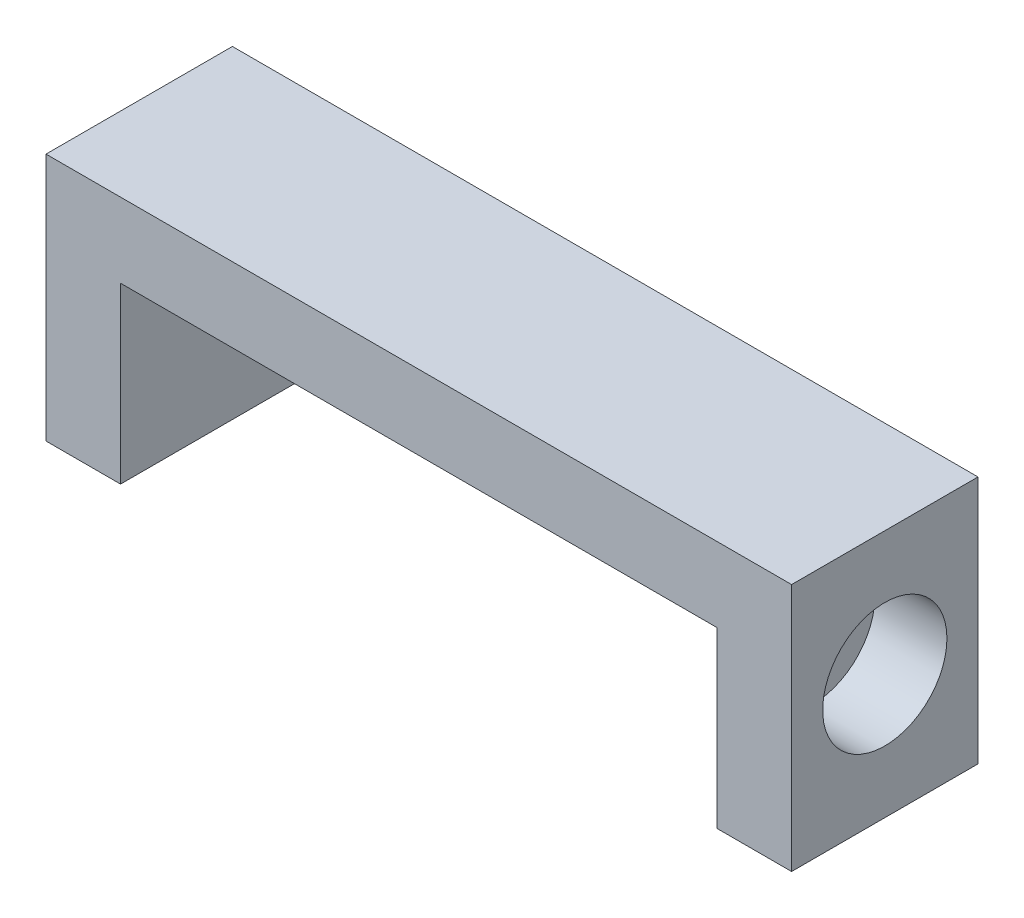
ISO-10303-21;
HEADER;
FILE_DESCRIPTION(('STEP AP214'),'2;1');
FILE_NAME('part.step','',(''),(''),'','','');
FILE_SCHEMA(('AUTOMOTIVE_DESIGN { 1 0 10303 214 1 1 1 1 }'));
ENDSEC;
DATA;
#1=APPLICATION_CONTEXT('core data for automotive mechanical design processes');
#2=APPLICATION_PROTOCOL_DEFINITION('international standard','automotive_design',2000,#1);
#3=PRODUCT_CONTEXT('',#1,'mechanical');
#4=PRODUCT('Part','Part','',(#3));
#5=PRODUCT_RELATED_PRODUCT_CATEGORY('part','',(#4));
#6=PRODUCT_DEFINITION_FORMATION('','',#4);
#7=PRODUCT_DEFINITION_CONTEXT('part definition',#1,'design');
#8=PRODUCT_DEFINITION('design','',#6,#7);
#9=PRODUCT_DEFINITION_SHAPE('','',#8);
#10=(LENGTH_UNIT() NAMED_UNIT(*) SI_UNIT(.MILLI.,.METRE.));
#11=(NAMED_UNIT(*) PLANE_ANGLE_UNIT() SI_UNIT($,.RADIAN.));
#12=(NAMED_UNIT(*) SI_UNIT($,.STERADIAN.) SOLID_ANGLE_UNIT());
#13=UNCERTAINTY_MEASURE_WITH_UNIT(LENGTH_MEASURE(1.E-05),#10,'distance_accuracy_value','');
#14=(GEOMETRIC_REPRESENTATION_CONTEXT(3) GLOBAL_UNCERTAINTY_ASSIGNED_CONTEXT((#13)) GLOBAL_UNIT_ASSIGNED_CONTEXT((#10,
#11,#12)) REPRESENTATION_CONTEXT('',''));
#15=CARTESIAN_POINT('',(0.,0.,0.));
#16=DIRECTION('',(0.,0.,1.));
#17=DIRECTION('',(1.,0.,0.));
#18=AXIS2_PLACEMENT_3D('',#15,#16,#17);
#19=CARTESIAN_POINT('',(-15.,0.,0.));
#20=DIRECTION('',(1.,0.,0.));
#21=DIRECTION('',(0.,0.,-1.));
#22=AXIS2_PLACEMENT_3D('',#19,#20,#21);
#23=CYLINDRICAL_SURFACE('',#22,2.5);
#24=CARTESIAN_POINT('',(-12.1,0.,0.));
#25=DIRECTION('',(-1.,0.,0.));
#26=DIRECTION('',(0.,0.,1.));
#27=AXIS2_PLACEMENT_3D('',#24,#25,#26);
#28=CIRCLE('',#27,2.5);
#29=CARTESIAN_POINT('',(-12.1,0.,2.5));
#30=VERTEX_POINT('',#29);
#31=EDGE_CURVE('E213',#30,#30,#28,.T.);
#32=ORIENTED_EDGE('',*,*,#31,.F.);
#33=EDGE_LOOP('',(#32));
#34=FACE_BOUND('',#33,.T.);
#35=CARTESIAN_POINT('',(-15.,0.,0.));
#36=DIRECTION('',(1.,0.,0.));
#37=DIRECTION('',(0.,0.,-1.));
#38=AXIS2_PLACEMENT_3D('',#35,#36,#37);
#39=CIRCLE('',#38,2.5);
#40=CARTESIAN_POINT('',(-15.,0.,-2.5));
#41=VERTEX_POINT('',#40);
#42=EDGE_CURVE('E173',#41,#41,#39,.T.);
#43=ORIENTED_EDGE('',*,*,#42,.F.);
#44=EDGE_LOOP('',(#43));
#45=FACE_BOUND('',#44,.T.);
#46=ADVANCED_FACE('F33',(#34,#45),#23,.F.);
#47=CARTESIAN_POINT('',(-15.,-5.,3.75));
#48=DIRECTION('',(0.,1.,0.));
#49=DIRECTION('',(0.,0.,1.));
#50=AXIS2_PLACEMENT_3D('',#47,#48,#49);
#51=PLANE('',#50);
#52=DIRECTION('',(1.,0.,0.));
#53=VECTOR('',#52,1.);
#54=CARTESIAN_POINT('',(-15.,-5.,-3.75));
#55=LINE('',#54,#53);
#56=CARTESIAN_POINT('',(-15.,-5.,-3.75));
#57=VERTEX_POINT('',#56);
#58=CARTESIAN_POINT('',(-12.,-5.,-3.75));
#59=VERTEX_POINT('',#58);
#60=EDGE_CURVE('E122',#57,#59,#55,.T.);
#61=ORIENTED_EDGE('',*,*,#60,.T.);
#62=DIRECTION('',(0.,0.,1.));
#63=VECTOR('',#62,1.);
#64=CARTESIAN_POINT('',(-12.,-5.,-3.751));
#65=LINE('',#64,#63);
#66=CARTESIAN_POINT('',(-12.,-5.,3.75));
#67=VERTEX_POINT('',#66);
#68=EDGE_CURVE('E104',#59,#67,#65,.T.);
#69=ORIENTED_EDGE('',*,*,#68,.T.);
#70=DIRECTION('',(1.,0.,0.));
#71=VECTOR('',#70,1.);
#72=CARTESIAN_POINT('',(-15.,-5.,3.75));
#73=LINE('',#72,#71);
#74=CARTESIAN_POINT('',(-15.,-5.,3.75));
#75=VERTEX_POINT('',#74);
#76=EDGE_CURVE('E142',#75,#67,#73,.T.);
#77=ORIENTED_EDGE('',*,*,#76,.F.);
#78=DIRECTION('',(0.,0.,-1.));
#79=VECTOR('',#78,1.);
#80=CARTESIAN_POINT('',(-15.,-5.,3.75));
#81=LINE('',#80,#79);
#82=EDGE_CURVE('E42',#75,#57,#81,.T.);
#83=ORIENTED_EDGE('',*,*,#82,.T.);
#84=EDGE_LOOP('',(#61,#69,#77,#83));
#85=FACE_BOUND('',#84,.T.);
#86=ADVANCED_FACE('F124',(#85),#51,.F.);
#87=CARTESIAN_POINT('',(-15.,5.,3.75));
#88=DIRECTION('',(0.,1.,0.));
#89=DIRECTION('',(0.,0.,1.));
#90=AXIS2_PLACEMENT_3D('',#87,#88,#89);
#91=PLANE('',#90);
#92=DIRECTION('',(0.,0.,-1.));
#93=VECTOR('',#92,1.);
#94=CARTESIAN_POINT('',(15.,5.,3.75));
#95=LINE('',#94,#93);
#96=CARTESIAN_POINT('',(15.,5.,3.75));
#97=VERTEX_POINT('',#96);
#98=CARTESIAN_POINT('',(15.,5.,-3.75));
#99=VERTEX_POINT('',#98);
#100=EDGE_CURVE('E37',#97,#99,#95,.T.);
#101=ORIENTED_EDGE('',*,*,#100,.T.);
#102=DIRECTION('',(1.,0.,0.));
#103=VECTOR('',#102,1.);
#104=CARTESIAN_POINT('',(-15.,5.,-3.75));
#105=LINE('',#104,#103);
#106=CARTESIAN_POINT('',(-15.,5.,-3.75));
#107=VERTEX_POINT('',#106);
#108=EDGE_CURVE('E148',#107,#99,#105,.T.);
#109=ORIENTED_EDGE('',*,*,#108,.F.);
#110=DIRECTION('',(0.,0.,-1.));
#111=VECTOR('',#110,1.);
#112=CARTESIAN_POINT('',(-15.,5.,3.75));
#113=LINE('',#112,#111);
#114=CARTESIAN_POINT('',(-15.,5.,3.75));
#115=VERTEX_POINT('',#114);
#116=EDGE_CURVE('E11',#115,#107,#113,.T.);
#117=ORIENTED_EDGE('',*,*,#116,.F.);
#118=DIRECTION('',(1.,0.,0.));
#119=VECTOR('',#118,1.);
#120=CARTESIAN_POINT('',(-15.,5.,3.75));
#121=LINE('',#120,#119);
#122=EDGE_CURVE('E80',#115,#97,#121,.T.);
#123=ORIENTED_EDGE('',*,*,#122,.T.);
#124=EDGE_LOOP('',(#101,#109,#117,#123));
#125=FACE_BOUND('',#124,.T.);
#126=ADVANCED_FACE('F35',(#125),#91,.T.);
#127=CARTESIAN_POINT('',(-15.,-5.,3.75));
#128=DIRECTION('',(-1.,0.,0.));
#129=DIRECTION('',(0.,0.,1.));
#130=AXIS2_PLACEMENT_3D('',#127,#128,#129);
#131=PLANE('',#130);
#132=ORIENTED_EDGE('',*,*,#42,.T.);
#133=EDGE_LOOP('',(#132));
#134=FACE_BOUND('',#133,.T.);
#135=DIRECTION('',(0.,1.,0.));
#136=VECTOR('',#135,1.);
#137=CARTESIAN_POINT('',(-15.,-5.,-3.75));
#138=LINE('',#137,#136);
#139=EDGE_CURVE('E125',#57,#107,#138,.T.);
#140=ORIENTED_EDGE('',*,*,#139,.F.);
#141=ORIENTED_EDGE('',*,*,#82,.F.);
#142=DIRECTION('',(0.,1.,0.));
#143=VECTOR('',#142,1.);
#144=CARTESIAN_POINT('',(-15.,-5.,3.75));
#145=LINE('',#144,#143);
#146=EDGE_CURVE('E140',#75,#115,#145,.T.);
#147=ORIENTED_EDGE('',*,*,#146,.T.);
#148=ORIENTED_EDGE('',*,*,#116,.T.);
#149=EDGE_LOOP('',(#140,#141,#147,#148));
#150=FACE_BOUND('',#149,.T.);
#151=ADVANCED_FACE('F228',(#134,#150),#131,.T.);
#152=CARTESIAN_POINT('',(12.,-5.,3.75));
#153=VERTEX_POINT('',#152);
#154=CARTESIAN_POINT('',(15.,-5.,3.75));
#155=VERTEX_POINT('',#154);
#156=EDGE_CURVE('E145',#153,#155,#73,.T.);
#157=ORIENTED_EDGE('',*,*,#156,.F.);
#158=DIRECTION('',(0.,0.,1.));
#159=VECTOR('',#158,1.);
#160=CARTESIAN_POINT('',(12.,-5.,-3.751));
#161=LINE('',#160,#159);
#162=CARTESIAN_POINT('',(12.,-5.,-3.75));
#163=VERTEX_POINT('',#162);
#164=EDGE_CURVE('E114',#163,#153,#161,.T.);
#165=ORIENTED_EDGE('',*,*,#164,.F.);
#166=CARTESIAN_POINT('',(15.,-5.,-3.75));
#167=VERTEX_POINT('',#166);
#168=EDGE_CURVE('E126',#163,#167,#55,.T.);
#169=ORIENTED_EDGE('',*,*,#168,.T.);
#170=DIRECTION('',(0.,0.,-1.));
#171=VECTOR('',#170,1.);
#172=CARTESIAN_POINT('',(15.,-5.,3.75));
#173=LINE('',#172,#171);
#174=EDGE_CURVE('E133',#155,#167,#173,.T.);
#175=ORIENTED_EDGE('',*,*,#174,.F.);
#176=EDGE_LOOP('',(#157,#165,#169,#175));
#177=FACE_BOUND('',#176,.T.);
#178=ADVANCED_FACE('F168',(#177),#51,.F.);
#179=CARTESIAN_POINT('',(15.,-5.,3.75));
#180=DIRECTION('',(-1.,0.,0.));
#181=DIRECTION('',(0.,0.,1.));
#182=AXIS2_PLACEMENT_3D('',#179,#180,#181);
#183=PLANE('',#182);
#184=CARTESIAN_POINT('',(15.,0.,0.));
#185=DIRECTION('',(1.,0.,0.));
#186=DIRECTION('',(0.,0.,-1.));
#187=AXIS2_PLACEMENT_3D('',#184,#185,#186);
#188=CIRCLE('',#187,2.5);
#189=CARTESIAN_POINT('',(15.,0.,-2.5));
#190=VERTEX_POINT('',#189);
#191=EDGE_CURVE('E177',#190,#190,#188,.T.);
#192=ORIENTED_EDGE('',*,*,#191,.F.);
#193=EDGE_LOOP('',(#192));
#194=FACE_BOUND('',#193,.T.);
#195=DIRECTION('',(0.,1.,0.));
#196=VECTOR('',#195,1.);
#197=CARTESIAN_POINT('',(15.,-5.,-3.75));
#198=LINE('',#197,#196);
#199=EDGE_CURVE('E129',#167,#99,#198,.T.);
#200=ORIENTED_EDGE('',*,*,#199,.T.);
#201=ORIENTED_EDGE('',*,*,#100,.F.);
#202=DIRECTION('',(0.,1.,0.));
#203=VECTOR('',#202,1.);
#204=CARTESIAN_POINT('',(15.,-5.,3.75));
#205=LINE('',#204,#203);
#206=EDGE_CURVE('E158',#155,#97,#205,.T.);
#207=ORIENTED_EDGE('',*,*,#206,.F.);
#208=ORIENTED_EDGE('',*,*,#174,.T.);
#209=EDGE_LOOP('',(#200,#201,#207,#208));
#210=FACE_BOUND('',#209,.T.);
#211=ADVANCED_FACE('F170',(#194,#210),#183,.F.);
#212=CARTESIAN_POINT('',(0.,0.,3.75));
#213=DIRECTION('',(0.,0.,1.));
#214=DIRECTION('',(1.,0.,0.));
#215=AXIS2_PLACEMENT_3D('',#212,#213,#214);
#216=PLANE('',#215);
#217=ORIENTED_EDGE('',*,*,#206,.T.);
#218=ORIENTED_EDGE('',*,*,#122,.F.);
#219=ORIENTED_EDGE('',*,*,#146,.F.);
#220=ORIENTED_EDGE('',*,*,#76,.T.);
#221=DIRECTION('',(0.,-1.,0.));
#222=VECTOR('',#221,1.);
#223=CARTESIAN_POINT('',(-12.,-5.,3.75));
#224=LINE('',#223,#222);
#225=CARTESIAN_POINT('',(-12.,2.,3.75));
#226=VERTEX_POINT('',#225);
#227=EDGE_CURVE('E109',#226,#67,#224,.T.);
#228=ORIENTED_EDGE('',*,*,#227,.F.);
#229=DIRECTION('',(-1.,0.,0.));
#230=VECTOR('',#229,1.);
#231=CARTESIAN_POINT('',(-12.,2.,3.75));
#232=LINE('',#231,#230);
#233=CARTESIAN_POINT('',(12.,2.,3.75));
#234=VERTEX_POINT('',#233);
#235=EDGE_CURVE('E115',#234,#226,#232,.T.);
#236=ORIENTED_EDGE('',*,*,#235,.F.);
#237=DIRECTION('',(0.,1.,0.));
#238=VECTOR('',#237,1.);
#239=CARTESIAN_POINT('',(12.,-5.,3.75));
#240=LINE('',#239,#238);
#241=EDGE_CURVE('E165',#153,#234,#240,.T.);
#242=ORIENTED_EDGE('',*,*,#241,.F.);
#243=ORIENTED_EDGE('',*,*,#156,.T.);
#244=EDGE_LOOP('',(#217,#218,#219,#220,#228,#236,#242,#243));
#245=FACE_BOUND('',#244,.T.);
#246=ADVANCED_FACE('F162',(#245),#216,.T.);
#247=CARTESIAN_POINT('',(0.,0.,-3.75));
#248=DIRECTION('',(0.,0.,1.));
#249=DIRECTION('',(1.,0.,0.));
#250=AXIS2_PLACEMENT_3D('',#247,#248,#249);
#251=PLANE('',#250);
#252=DIRECTION('',(0.,-1.,0.));
#253=VECTOR('',#252,1.);
#254=CARTESIAN_POINT('',(12.,-5.,-3.75));
#255=LINE('',#254,#253);
#256=CARTESIAN_POINT('',(12.,2.,-3.75));
#257=VERTEX_POINT('',#256);
#258=EDGE_CURVE('E171',#257,#163,#255,.T.);
#259=ORIENTED_EDGE('',*,*,#258,.F.);
#260=DIRECTION('',(1.,0.,0.));
#261=VECTOR('',#260,1.);
#262=CARTESIAN_POINT('',(-12.,2.,-3.75));
#263=LINE('',#262,#261);
#264=CARTESIAN_POINT('',(-12.,2.,-3.75));
#265=VERTEX_POINT('',#264);
#266=EDGE_CURVE('E50',#265,#257,#263,.T.);
#267=ORIENTED_EDGE('',*,*,#266,.F.);
#268=DIRECTION('',(0.,1.,0.));
#269=VECTOR('',#268,1.);
#270=CARTESIAN_POINT('',(-12.,-5.,-3.75));
#271=LINE('',#270,#269);
#272=EDGE_CURVE('E107',#59,#265,#271,.T.);
#273=ORIENTED_EDGE('',*,*,#272,.F.);
#274=ORIENTED_EDGE('',*,*,#60,.F.);
#275=ORIENTED_EDGE('',*,*,#139,.T.);
#276=ORIENTED_EDGE('',*,*,#108,.T.);
#277=ORIENTED_EDGE('',*,*,#199,.F.);
#278=ORIENTED_EDGE('',*,*,#168,.F.);
#279=EDGE_LOOP('',(#259,#267,#273,#274,#275,#276,#277,#278));
#280=FACE_BOUND('',#279,.T.);
#281=ADVANCED_FACE('F120',(#280),#251,.F.);
#282=CARTESIAN_POINT('',(-12.,-5.,-3.751));
#283=DIRECTION('',(-1.,0.,0.));
#284=DIRECTION('',(0.,0.,1.));
#285=AXIS2_PLACEMENT_3D('',#282,#283,#284);
#286=PLANE('',#285);
#287=DIRECTION('',(0.,0.,1.));
#288=VECTOR('',#287,1.);
#289=CARTESIAN_POINT('',(-12.,2.,-3.751));
#290=LINE('',#289,#288);
#291=EDGE_CURVE('E149',#265,#226,#290,.T.);
#292=ORIENTED_EDGE('',*,*,#291,.T.);
#293=ORIENTED_EDGE('',*,*,#227,.T.);
#294=ORIENTED_EDGE('',*,*,#68,.F.);
#295=ORIENTED_EDGE('',*,*,#272,.T.);
#296=EDGE_LOOP('',(#292,#293,#294,#295));
#297=FACE_BOUND('',#296,.T.);
#298=ADVANCED_FACE('F106',(#297),#286,.F.);
#299=CARTESIAN_POINT('',(-12.,2.,-3.751));
#300=DIRECTION('',(0.,1.,0.));
#301=DIRECTION('',(0.,0.,1.));
#302=AXIS2_PLACEMENT_3D('',#299,#300,#301);
#303=PLANE('',#302);
#304=DIRECTION('',(0.,0.,1.));
#305=VECTOR('',#304,1.);
#306=CARTESIAN_POINT('',(12.,2.,-3.751));
#307=LINE('',#306,#305);
#308=EDGE_CURVE('E150',#257,#234,#307,.T.);
#309=ORIENTED_EDGE('',*,*,#308,.T.);
#310=ORIENTED_EDGE('',*,*,#235,.T.);
#311=ORIENTED_EDGE('',*,*,#291,.F.);
#312=ORIENTED_EDGE('',*,*,#266,.T.);
#313=EDGE_LOOP('',(#309,#310,#311,#312));
#314=FACE_BOUND('',#313,.T.);
#315=ADVANCED_FACE('F181',(#314),#303,.F.);
#316=CARTESIAN_POINT('',(12.,-5.,-3.751));
#317=DIRECTION('',(1.,0.,0.));
#318=DIRECTION('',(0.,0.,-1.));
#319=AXIS2_PLACEMENT_3D('',#316,#317,#318);
#320=PLANE('',#319);
#321=ORIENTED_EDGE('',*,*,#241,.T.);
#322=ORIENTED_EDGE('',*,*,#308,.F.);
#323=ORIENTED_EDGE('',*,*,#258,.T.);
#324=ORIENTED_EDGE('',*,*,#164,.T.);
#325=EDGE_LOOP('',(#321,#322,#323,#324));
#326=FACE_BOUND('',#325,.T.);
#327=ADVANCED_FACE('F182',(#326),#320,.F.);
#328=CARTESIAN_POINT('',(12.1,0.,0.));
#329=DIRECTION('',(1.,0.,0.));
#330=DIRECTION('',(0.,0.,-1.));
#331=AXIS2_PLACEMENT_3D('',#328,#329,#330);
#332=CIRCLE('',#331,2.5);
#333=CARTESIAN_POINT('',(12.1,0.,-2.5));
#334=VERTEX_POINT('',#333);
#335=EDGE_CURVE('E214',#334,#334,#332,.T.);
#336=ORIENTED_EDGE('',*,*,#335,.F.);
#337=EDGE_LOOP('',(#336));
#338=FACE_BOUND('',#337,.T.);
#339=ORIENTED_EDGE('',*,*,#191,.T.);
#340=EDGE_LOOP('',(#339));
#341=FACE_BOUND('',#340,.T.);
#342=ADVANCED_FACE('F184',(#338,#341),#23,.F.);
#343=CARTESIAN_POINT('',(12.1,0.,0.));
#344=DIRECTION('',(1.,0.,0.));
#345=DIRECTION('',(0.,0.,-1.));
#346=AXIS2_PLACEMENT_3D('',#343,#344,#345);
#347=PLANE('',#346);
#348=ORIENTED_EDGE('',*,*,#335,.T.);
#349=EDGE_LOOP('',(#348));
#350=FACE_BOUND('',#349,.T.);
#351=ADVANCED_FACE('F190',(#350),#347,.T.);
#352=CARTESIAN_POINT('',(-12.1,0.,0.));
#353=DIRECTION('',(-1.,0.,0.));
#354=DIRECTION('',(0.,0.,1.));
#355=AXIS2_PLACEMENT_3D('',#352,#353,#354);
#356=PLANE('',#355);
#357=ORIENTED_EDGE('',*,*,#31,.T.);
#358=EDGE_LOOP('',(#357));
#359=FACE_BOUND('',#358,.T.);
#360=ADVANCED_FACE('F206',(#359),#356,.T.);
#361=CLOSED_SHELL('',(#46,#86,#126,#151,#178,#211,#246,#281,#298,#315,#327,#342,#351,#360));
#362=MANIFOLD_SOLID_BREP('B2',#361);
#363=ADVANCED_BREP_SHAPE_REPRESENTATION('',(#18,#362),#14);
#364=SHAPE_DEFINITION_REPRESENTATION(#9,#363);
ENDSEC;
END-ISO-10303-21;
